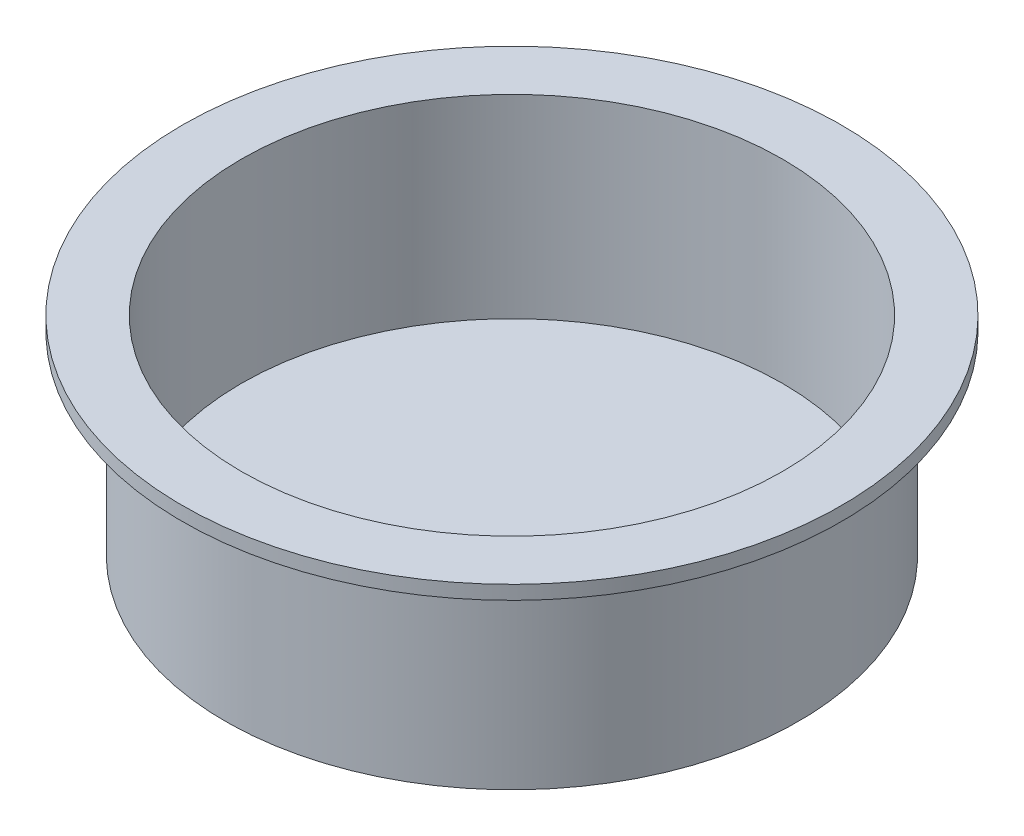
ISO-10303-21;
HEADER;
FILE_DESCRIPTION(('STEP AP214'),'2;1');
FILE_NAME('part.step','',(''),(''),'','','');
FILE_SCHEMA(('AUTOMOTIVE_DESIGN { 1 0 10303 214 1 1 1 1 }'));
ENDSEC;
DATA;
#1=APPLICATION_CONTEXT('core data for automotive mechanical design processes');
#2=APPLICATION_PROTOCOL_DEFINITION('international standard','automotive_design',2000,#1);
#3=PRODUCT_CONTEXT('',#1,'mechanical');
#4=PRODUCT('Part','Part','',(#3));
#5=PRODUCT_RELATED_PRODUCT_CATEGORY('part','',(#4));
#6=PRODUCT_DEFINITION_FORMATION('','',#4);
#7=PRODUCT_DEFINITION_CONTEXT('part definition',#1,'design');
#8=PRODUCT_DEFINITION('design','',#6,#7);
#9=PRODUCT_DEFINITION_SHAPE('','',#8);
#10=(LENGTH_UNIT() NAMED_UNIT(*) SI_UNIT(.MILLI.,.METRE.));
#11=(NAMED_UNIT(*) PLANE_ANGLE_UNIT() SI_UNIT($,.RADIAN.));
#12=(NAMED_UNIT(*) SI_UNIT($,.STERADIAN.) SOLID_ANGLE_UNIT());
#13=UNCERTAINTY_MEASURE_WITH_UNIT(LENGTH_MEASURE(1.E-05),#10,'distance_accuracy_value','');
#14=(GEOMETRIC_REPRESENTATION_CONTEXT(3) GLOBAL_UNCERTAINTY_ASSIGNED_CONTEXT((#13)) GLOBAL_UNIT_ASSIGNED_CONTEXT((#10,
#11,#12)) REPRESENTATION_CONTEXT('',''));
#15=CARTESIAN_POINT('',(0.,0.,0.));
#16=DIRECTION('',(0.,0.,1.));
#17=DIRECTION('',(1.,0.,0.));
#18=AXIS2_PLACEMENT_3D('',#15,#16,#17);
#19=CARTESIAN_POINT('',(0.,0.,0.));
#20=DIRECTION('',(0.,1.,0.));
#21=DIRECTION('',(-1.,0.,0.));
#22=AXIS2_PLACEMENT_3D('',#19,#20,#21);
#23=PLANE('',#22);
#24=CARTESIAN_POINT('',(0.,0.,0.));
#25=DIRECTION('',(0.,1.,0.));
#26=DIRECTION('',(-1.,0.,0.));
#27=AXIS2_PLACEMENT_3D('',#24,#25,#26);
#28=CIRCLE('',#27,26.2509);
#29=CARTESIAN_POINT('',(-26.2509,0.,0.));
#30=VERTEX_POINT('',#29);
#31=EDGE_CURVE('E10',#30,#30,#28,.T.);
#32=ORIENTED_EDGE('',*,*,#31,.F.);
#33=EDGE_LOOP('',(#32));
#34=FACE_BOUND('',#33,.T.);
#35=ADVANCED_FACE('F33',(#34),#23,.F.);
#36=CARTESIAN_POINT('',(0.,19.05,0.));
#37=DIRECTION('',(0.,1.,0.));
#38=DIRECTION('',(-1.,0.,0.));
#39=AXIS2_PLACEMENT_3D('',#36,#37,#38);
#40=CYLINDRICAL_SURFACE('',#39,26.2509);
#41=CARTESIAN_POINT('',(0.,17.78,0.));
#42=DIRECTION('',(0.,1.,0.));
#43=DIRECTION('',(-1.,0.,0.));
#44=AXIS2_PLACEMENT_3D('',#41,#42,#43);
#45=CIRCLE('',#44,26.2509);
#46=CARTESIAN_POINT('',(-26.2509,17.78,0.));
#47=VERTEX_POINT('',#46);
#48=EDGE_CURVE('E39',#47,#47,#45,.T.);
#49=ORIENTED_EDGE('',*,*,#48,.F.);
#50=EDGE_LOOP('',(#49));
#51=FACE_BOUND('',#50,.T.);
#52=ORIENTED_EDGE('',*,*,#31,.T.);
#53=EDGE_LOOP('',(#52));
#54=FACE_BOUND('',#53,.T.);
#55=ADVANCED_FACE('F81',(#51,#54),#40,.T.);
#56=CARTESIAN_POINT('',(26.2509,17.78,0.));
#57=DIRECTION('',(0.,1.,0.));
#58=DIRECTION('',(-1.,0.,0.));
#59=AXIS2_PLACEMENT_3D('',#56,#57,#58);
#60=PLANE('',#59);
#61=CARTESIAN_POINT('',(0.,17.78,0.));
#62=DIRECTION('',(0.,1.,0.));
#63=DIRECTION('',(-1.,0.,0.));
#64=AXIS2_PLACEMENT_3D('',#61,#62,#63);
#65=CIRCLE('',#64,30.1625);
#66=CARTESIAN_POINT('',(-30.1625,17.78,0.));
#67=VERTEX_POINT('',#66);
#68=EDGE_CURVE('E43',#67,#67,#65,.T.);
#69=ORIENTED_EDGE('',*,*,#68,.F.);
#70=EDGE_LOOP('',(#69));
#71=FACE_BOUND('',#70,.T.);
#72=ORIENTED_EDGE('',*,*,#48,.T.);
#73=EDGE_LOOP('',(#72));
#74=FACE_BOUND('',#73,.T.);
#75=ADVANCED_FACE('F76',(#71,#74),#60,.F.);
#76=CARTESIAN_POINT('',(0.,19.05,0.));
#77=DIRECTION('',(0.,1.,0.));
#78=DIRECTION('',(-1.,0.,0.));
#79=AXIS2_PLACEMENT_3D('',#76,#77,#78);
#80=CYLINDRICAL_SURFACE('',#79,30.1625);
#81=CARTESIAN_POINT('',(0.,19.05,0.));
#82=DIRECTION('',(0.,1.,0.));
#83=DIRECTION('',(-1.,0.,0.));
#84=AXIS2_PLACEMENT_3D('',#81,#82,#83);
#85=CIRCLE('',#84,30.1625);
#86=CARTESIAN_POINT('',(-30.1625,19.05,0.));
#87=VERTEX_POINT('',#86);
#88=EDGE_CURVE('E47',#87,#87,#85,.T.);
#89=ORIENTED_EDGE('',*,*,#88,.F.);
#90=EDGE_LOOP('',(#89));
#91=FACE_BOUND('',#90,.T.);
#92=ORIENTED_EDGE('',*,*,#68,.T.);
#93=EDGE_LOOP('',(#92));
#94=FACE_BOUND('',#93,.T.);
#95=ADVANCED_FACE('F70',(#91,#94),#80,.T.);
#96=CARTESIAN_POINT('',(30.1625,19.05,0.));
#97=DIRECTION('',(0.,-1.,0.));
#98=DIRECTION('',(1.,0.,0.));
#99=AXIS2_PLACEMENT_3D('',#96,#97,#98);
#100=PLANE('',#99);
#101=CARTESIAN_POINT('',(0.,19.05,0.));
#102=DIRECTION('',(0.,1.,0.));
#103=DIRECTION('',(-1.,0.,0.));
#104=AXIS2_PLACEMENT_3D('',#101,#102,#103);
#105=CIRCLE('',#104,24.765);
#106=CARTESIAN_POINT('',(-24.765,19.05,0.));
#107=VERTEX_POINT('',#106);
#108=EDGE_CURVE('E53',#107,#107,#105,.T.);
#109=ORIENTED_EDGE('',*,*,#108,.F.);
#110=EDGE_LOOP('',(#109));
#111=FACE_BOUND('',#110,.T.);
#112=ORIENTED_EDGE('',*,*,#88,.T.);
#113=EDGE_LOOP('',(#112));
#114=FACE_BOUND('',#113,.T.);
#115=ADVANCED_FACE('F64',(#111,#114),#100,.F.);
#116=CARTESIAN_POINT('',(0.,1.27000000000001,0.));
#117=DIRECTION('',(0.,1.,0.));
#118=DIRECTION('',(-1.,0.,0.));
#119=AXIS2_PLACEMENT_3D('',#116,#117,#118);
#120=CYLINDRICAL_SURFACE('',#119,24.765);
#121=CARTESIAN_POINT('',(0.,1.27000000000001,0.));
#122=DIRECTION('',(0.,1.,0.));
#123=DIRECTION('',(-1.,0.,0.));
#124=AXIS2_PLACEMENT_3D('',#121,#122,#123);
#125=CIRCLE('',#124,24.765);
#126=CARTESIAN_POINT('',(-24.765,1.27000000000001,0.));
#127=VERTEX_POINT('',#126);
#128=EDGE_CURVE('E52',#127,#127,#125,.T.);
#129=ORIENTED_EDGE('',*,*,#128,.F.);
#130=EDGE_LOOP('',(#129));
#131=FACE_BOUND('',#130,.T.);
#132=ORIENTED_EDGE('',*,*,#108,.T.);
#133=EDGE_LOOP('',(#132));
#134=FACE_BOUND('',#133,.T.);
#135=ADVANCED_FACE('F61',(#131,#134),#120,.F.);
#136=CARTESIAN_POINT('',(0.,1.27000000000001,0.));
#137=DIRECTION('',(0.,1.,0.));
#138=DIRECTION('',(-1.,0.,0.));
#139=AXIS2_PLACEMENT_3D('',#136,#137,#138);
#140=PLANE('',#139);
#141=ORIENTED_EDGE('',*,*,#128,.T.);
#142=EDGE_LOOP('',(#141));
#143=FACE_BOUND('',#142,.T.);
#144=ADVANCED_FACE('F59',(#143),#140,.T.);
#145=CLOSED_SHELL('',(#35,#55,#75,#95,#115,#135,#144));
#146=MANIFOLD_SOLID_BREP('B2',#145);
#147=ADVANCED_BREP_SHAPE_REPRESENTATION('',(#18,#146),#14);
#148=SHAPE_DEFINITION_REPRESENTATION(#9,#147);
ENDSEC;
END-ISO-10303-21;
